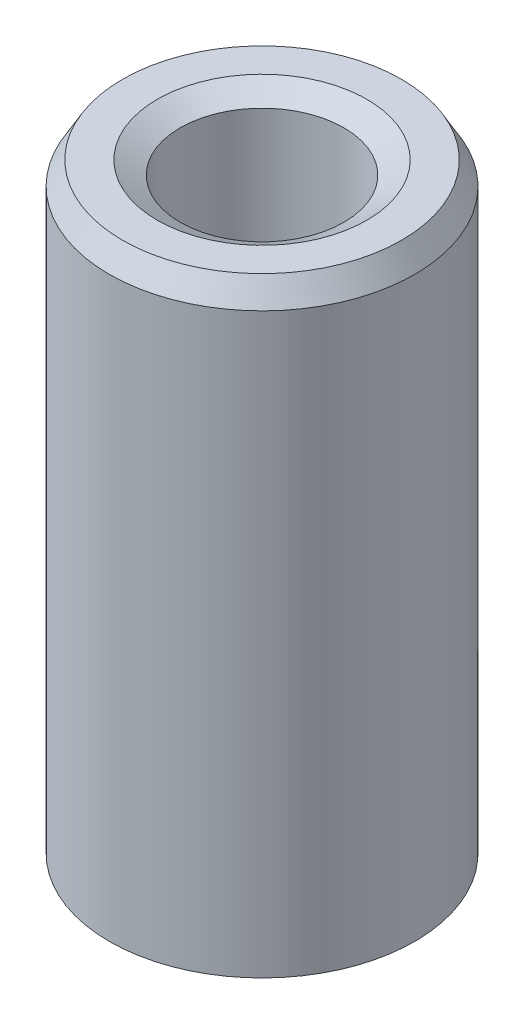
ISO-10303-21;
HEADER;
FILE_DESCRIPTION(('STEP AP214'),'2;1');
FILE_NAME('part.step','',(''),(''),'','','');
FILE_SCHEMA(('AUTOMOTIVE_DESIGN { 1 0 10303 214 1 1 1 1 }'));
ENDSEC;
DATA;
#1=APPLICATION_CONTEXT('core data for automotive mechanical design processes');
#2=APPLICATION_PROTOCOL_DEFINITION('international standard','automotive_design',2000,#1);
#3=PRODUCT_CONTEXT('',#1,'mechanical');
#4=PRODUCT('Part','Part','',(#3));
#5=PRODUCT_RELATED_PRODUCT_CATEGORY('part','',(#4));
#6=PRODUCT_DEFINITION_FORMATION('','',#4);
#7=PRODUCT_DEFINITION_CONTEXT('part definition',#1,'design');
#8=PRODUCT_DEFINITION('design','',#6,#7);
#9=PRODUCT_DEFINITION_SHAPE('','',#8);
#10=(LENGTH_UNIT() NAMED_UNIT(*) SI_UNIT(.MILLI.,.METRE.));
#11=(NAMED_UNIT(*) PLANE_ANGLE_UNIT() SI_UNIT($,.RADIAN.));
#12=(NAMED_UNIT(*) SI_UNIT($,.STERADIAN.) SOLID_ANGLE_UNIT());
#13=UNCERTAINTY_MEASURE_WITH_UNIT(LENGTH_MEASURE(1.E-05),#10,'distance_accuracy_value','');
#14=(GEOMETRIC_REPRESENTATION_CONTEXT(3) GLOBAL_UNCERTAINTY_ASSIGNED_CONTEXT((#13)) GLOBAL_UNIT_ASSIGNED_CONTEXT((#10,
#11,#12)) REPRESENTATION_CONTEXT('',''));
#15=CARTESIAN_POINT('',(0.,0.,0.));
#16=DIRECTION('',(0.,0.,1.));
#17=DIRECTION('',(1.,0.,0.));
#18=AXIS2_PLACEMENT_3D('',#15,#16,#17);
#19=CARTESIAN_POINT('',(0.,60.2965456338634,0.));
#20=DIRECTION('',(0.,-1.,0.));
#21=DIRECTION('',(0.,0.,-1.));
#22=AXIS2_PLACEMENT_3D('',#19,#20,#21);
#23=CYLINDRICAL_SURFACE('',#22,15.);
#24=CARTESIAN_POINT('',(0.,1.29841179703524,0.));
#25=DIRECTION('',(0.,1.,0.));
#26=DIRECTION('',(0.,0.,1.));
#27=AXIS2_PLACEMENT_3D('',#24,#25,#26);
#28=CIRCLE('',#27,15.);
#29=CARTESIAN_POINT('',(0.,1.29841179703524,15.));
#30=VERTEX_POINT('',#29);
#31=EDGE_CURVE('E10',#30,#30,#28,.T.);
#32=ORIENTED_EDGE('',*,*,#31,.T.);
#33=EDGE_LOOP('',(#32));
#34=FACE_BOUND('',#33,.T.);
#35=CARTESIAN_POINT('',(0.,58.0476304322516,0.));
#36=DIRECTION('',(0.,1.,0.));
#37=DIRECTION('',(0.,0.,1.));
#38=AXIS2_PLACEMENT_3D('',#35,#36,#37);
#39=CIRCLE('',#38,15.);
#40=CARTESIAN_POINT('',(0.,58.0476304322516,15.));
#41=VERTEX_POINT('',#40);
#42=EDGE_CURVE('E50',#41,#41,#39,.F.);
#43=ORIENTED_EDGE('',*,*,#42,.T.);
#44=EDGE_LOOP('',(#43));
#45=FACE_BOUND('',#44,.T.);
#46=ADVANCED_FACE('F39',(#34,#45),#23,.T.);
#47=CARTESIAN_POINT('',(0.,60.2965456338634,0.));
#48=DIRECTION('',(0.,1.,0.));
#49=DIRECTION('',(0.,0.,1.));
#50=AXIS2_PLACEMENT_3D('',#47,#48,#49);
#51=PLANE('',#50);
#52=CARTESIAN_POINT('',(0.,60.2965456338634,0.));
#53=DIRECTION('',(0.,1.,0.));
#54=DIRECTION('',(0.,0.,1.));
#55=AXIS2_PLACEMENT_3D('',#52,#53,#54);
#56=CIRCLE('',#55,10.293324658805);
#57=CARTESIAN_POINT('',(0.,60.2965456338634,10.293324658805));
#58=VERTEX_POINT('',#57);
#59=EDGE_CURVE('E58',#58,#58,#56,.F.);
#60=ORIENTED_EDGE('',*,*,#59,.T.);
#61=EDGE_LOOP('',(#60));
#62=FACE_BOUND('',#61,.T.);
#63=CARTESIAN_POINT('',(0.,60.2965456338634,0.));
#64=DIRECTION('',(0.,1.,0.));
#65=DIRECTION('',(0.,0.,1.));
#66=AXIS2_PLACEMENT_3D('',#63,#64,#65);
#67=CIRCLE('',#66,13.7015882029648);
#68=CARTESIAN_POINT('',(0.,60.2965456338634,13.7015882029648));
#69=VERTEX_POINT('',#68);
#70=EDGE_CURVE('E61',#69,#69,#67,.T.);
#71=ORIENTED_EDGE('',*,*,#70,.T.);
#72=EDGE_LOOP('',(#71));
#73=FACE_BOUND('',#72,.T.);
#74=ADVANCED_FACE('F88',(#62,#73),#51,.T.);
#75=CARTESIAN_POINT('',(0.,0.,0.));
#76=DIRECTION('',(0.,1.,0.));
#77=DIRECTION('',(0.,0.,1.));
#78=AXIS2_PLACEMENT_3D('',#75,#76,#77);
#79=PLANE('',#78);
#80=CARTESIAN_POINT('',(0.,0.,0.));
#81=DIRECTION('',(0.,1.,0.));
#82=DIRECTION('',(0.,0.,1.));
#83=AXIS2_PLACEMENT_3D('',#80,#81,#82);
#84=CIRCLE('',#83,9.34282125422839);
#85=CARTESIAN_POINT('',(0.,0.,9.34282125422839));
#86=VERTEX_POINT('',#85);
#87=EDGE_CURVE('E51',#86,#86,#84,.T.);
#88=ORIENTED_EDGE('',*,*,#87,.T.);
#89=EDGE_LOOP('',(#88));
#90=FACE_BOUND('',#89,.T.);
#91=CARTESIAN_POINT('',(0.,0.,0.));
#92=DIRECTION('',(0.,1.,0.));
#93=DIRECTION('',(0.,0.,1.));
#94=AXIS2_PLACEMENT_3D('',#91,#92,#93);
#95=CIRCLE('',#94,12.7510847983881);
#96=CARTESIAN_POINT('',(0.,0.,12.7510847983881));
#97=VERTEX_POINT('',#96);
#98=EDGE_CURVE('E54',#97,#97,#95,.F.);
#99=ORIENTED_EDGE('',*,*,#98,.T.);
#100=EDGE_LOOP('',(#99));
#101=FACE_BOUND('',#100,.T.);
#102=ADVANCED_FACE('F83',(#90,#101),#79,.F.);
#103=CARTESIAN_POINT('',(0.,60.2965456338634,0.));
#104=DIRECTION('',(0.,-1.,0.));
#105=DIRECTION('',(0.,0.,-1.));
#106=AXIS2_PLACEMENT_3D('',#103,#104,#105);
#107=CYLINDRICAL_SURFACE('',#106,8.04440945719315);
#108=CARTESIAN_POINT('',(0.,58.9981338368282,0.));
#109=DIRECTION('',(0.,1.,0.));
#110=DIRECTION('',(0.,0.,1.));
#111=AXIS2_PLACEMENT_3D('',#108,#109,#110);
#112=CIRCLE('',#111,8.04440945719315);
#113=CARTESIAN_POINT('',(0.,58.9981338368282,8.04440945719315));
#114=VERTEX_POINT('',#113);
#115=EDGE_CURVE('E67',#114,#114,#112,.T.);
#116=ORIENTED_EDGE('',*,*,#115,.T.);
#117=EDGE_LOOP('',(#116));
#118=FACE_BOUND('',#117,.T.);
#119=CARTESIAN_POINT('',(0.,2.24891520161187,0.));
#120=DIRECTION('',(0.,1.,0.));
#121=DIRECTION('',(0.,0.,1.));
#122=AXIS2_PLACEMENT_3D('',#119,#120,#121);
#123=CIRCLE('',#122,8.04440945719315);
#124=CARTESIAN_POINT('',(0.,2.24891520161187,8.04440945719315));
#125=VERTEX_POINT('',#124);
#126=EDGE_CURVE('E69',#125,#125,#123,.F.);
#127=ORIENTED_EDGE('',*,*,#126,.T.);
#128=EDGE_LOOP('',(#127));
#129=FACE_BOUND('',#128,.T.);
#130=ADVANCED_FACE('F71',(#118,#129),#107,.F.);
#131=CARTESIAN_POINT('',(0.,58.9981338368282,0.));
#132=DIRECTION('',(0.,1.,0.));
#133=DIRECTION('',(0.,0.,1.));
#134=AXIS2_PLACEMENT_3D('',#131,#132,#133);
#135=CONICAL_SURFACE('',#134,8.04440945719315,1.0471975511966);
#136=ORIENTED_EDGE('',*,*,#59,.F.);
#137=EDGE_LOOP('',(#136));
#138=FACE_BOUND('',#137,.T.);
#139=ORIENTED_EDGE('',*,*,#115,.F.);
#140=EDGE_LOOP('',(#139));
#141=FACE_BOUND('',#140,.T.);
#142=ADVANCED_FACE('F77',(#138,#141),#135,.F.);
#143=CARTESIAN_POINT('',(0.,0.,0.));
#144=DIRECTION('',(0.,-1.,0.));
#145=DIRECTION('',(0.,0.,-1.));
#146=AXIS2_PLACEMENT_3D('',#143,#144,#145);
#147=CONICAL_SURFACE('',#146,9.34282125422839,0.523598775598296);
#148=ORIENTED_EDGE('',*,*,#126,.F.);
#149=EDGE_LOOP('',(#148));
#150=FACE_BOUND('',#149,.T.);
#151=ORIENTED_EDGE('',*,*,#87,.F.);
#152=EDGE_LOOP('',(#151));
#153=FACE_BOUND('',#152,.T.);
#154=ADVANCED_FACE('F73',(#150,#153),#147,.F.);
#155=CARTESIAN_POINT('',(0.,1.29841179703524,0.));
#156=DIRECTION('',(0.,1.,0.));
#157=DIRECTION('',(0.,0.,1.));
#158=AXIS2_PLACEMENT_3D('',#155,#156,#157);
#159=CONICAL_SURFACE('',#158,15.,1.0471975511966);
#160=CARTESIAN_POINT('',(0.,0.,12.7510847983881));
#161=CARTESIAN_POINT('',(0.,0.0135251228857835,12.7745109984049));
#162=CARTESIAN_POINT('',(0.,0.0270502457715672,12.7979371984217));
#163=CARTESIAN_POINT('',(0.,0.0541004915431346,12.8447895984553));
#164=CARTESIAN_POINT('',(0.,0.0676256144289183,12.8682157984721));
#165=CARTESIAN_POINT('',(0.,0.0946758602004857,12.9150681985057));
#166=CARTESIAN_POINT('',(0.,0.108200983086269,12.9384943985225));
#167=CARTESIAN_POINT('',(0.,0.135251228857837,12.985346798556));
#168=CARTESIAN_POINT('',(0.,0.148776351743621,13.0087729985728));
#169=CARTESIAN_POINT('',(0.,0.175826597515188,13.0556253986064));
#170=CARTESIAN_POINT('',(0.,0.189351720400972,13.0790515986232));
#171=CARTESIAN_POINT('',(0.,0.216401966172539,13.1259039986568));
#172=CARTESIAN_POINT('',(0.,0.229927089058323,13.1493301986736));
#173=CARTESIAN_POINT('',(0.,0.25697733482989,13.1961825987071));
#174=CARTESIAN_POINT('',(0.,0.270502457715674,13.2196087987239));
#175=CARTESIAN_POINT('',(0.,0.297552703487241,13.2664611987575));
#176=CARTESIAN_POINT('',(0.,0.311077826373025,13.2898873987743));
#177=CARTESIAN_POINT('',(0.,0.338128072144592,13.3367397988079));
#178=CARTESIAN_POINT('',(0.,0.351653195030376,13.3601659988247));
#179=CARTESIAN_POINT('',(0.,0.378703440801944,13.4070183988583));
#180=CARTESIAN_POINT('',(0.,0.392228563687727,13.430444598875));
#181=CARTESIAN_POINT('',(0.,0.419278809459295,13.4772969989086));
#182=CARTESIAN_POINT('',(0.,0.432803932345079,13.5007231989254));
#183=CARTESIAN_POINT('',(0.,0.459854178116646,13.547575598959));
#184=CARTESIAN_POINT('',(0.,0.47337930100243,13.5710017989758));
#185=CARTESIAN_POINT('',(0.,0.500429546773997,13.6178541990094));
#186=CARTESIAN_POINT('',(0.,0.513954669659781,13.6412803990262));
#187=CARTESIAN_POINT('',(0.,0.541004915431348,13.6881327990597));
#188=CARTESIAN_POINT('',(0.,0.554530038317132,13.7115589990765));
#189=CARTESIAN_POINT('',(0.,0.581580284088699,13.7584113991101));
#190=CARTESIAN_POINT('',(0.,0.595105406974483,13.7818375991269));
#191=CARTESIAN_POINT('',(0.,0.62215565274605,13.8286899991605));
#192=CARTESIAN_POINT('',(0.,0.635680775631834,13.8521161991773));
#193=CARTESIAN_POINT('',(0.,0.662731021403401,13.8989685992109));
#194=CARTESIAN_POINT('',(0.,0.676256144289185,13.9223947992276));
#195=CARTESIAN_POINT('',(0.,0.703306390060753,13.9692471992612));
#196=CARTESIAN_POINT('',(0.,0.716831512946536,13.992673399278));
#197=CARTESIAN_POINT('',(0.,0.743881758718104,14.0395257993116));
#198=CARTESIAN_POINT('',(0.,0.757406881603888,14.0629519993284));
#199=CARTESIAN_POINT('',(0.,0.784457127375455,14.109804399362));
#200=CARTESIAN_POINT('',(0.,0.797982250261238,14.1332305993788));
#201=CARTESIAN_POINT('',(0.,0.825032496032806,14.1800829994123));
#202=CARTESIAN_POINT('',(0.,0.83855761891859,14.2035091994291));
#203=CARTESIAN_POINT('',(0.,0.865607864690157,14.2503615994627));
#204=CARTESIAN_POINT('',(0.,0.879132987575941,14.2737877994795));
#205=CARTESIAN_POINT('',(0.,0.906183233347508,14.3206401995131));
#206=CARTESIAN_POINT('',(0.,0.919708356233292,14.3440663995299));
#207=CARTESIAN_POINT('',(0.,0.946758602004859,14.3909187995635));
#208=CARTESIAN_POINT('',(0.,0.960283724890643,14.4143449995802));
#209=CARTESIAN_POINT('',(0.,0.987333970662211,14.4611973996138));
#210=CARTESIAN_POINT('',(0.,1.00085909354799,14.4846235996306));
#211=CARTESIAN_POINT('',(0.,1.02790933931956,14.5314759996642));
#212=CARTESIAN_POINT('',(0.,1.04143446220535,14.554902199681));
#213=CARTESIAN_POINT('',(0.,1.06848470797691,14.6017545997146));
#214=CARTESIAN_POINT('',(0.,1.0820098308627,14.6251807997314));
#215=CARTESIAN_POINT('',(0.,1.10906007663426,14.6720331997649));
#216=CARTESIAN_POINT('',(0.,1.12258519952005,14.6954593997817));
#217=CARTESIAN_POINT('',(0.,1.14963544529161,14.7423117998153));
#218=CARTESIAN_POINT('',(0.,1.1631605681774,14.7657379998321));
#219=CARTESIAN_POINT('',(0.,1.19021081394897,14.8125903998657));
#220=CARTESIAN_POINT('',(0.,1.20373593683475,14.8360165998825));
#221=CARTESIAN_POINT('',(0.,1.23078618260632,14.882868999916));
#222=CARTESIAN_POINT('',(0.,1.2443113054921,14.9062951999328));
#223=CARTESIAN_POINT('',(0.,1.27136155126367,14.9531475999664));
#224=CARTESIAN_POINT('',(0.,1.28488667414945,14.9765737999832));
#225=CARTESIAN_POINT('',(0.,1.29841179703524,15.));
#226=B_SPLINE_CURVE_WITH_KNOTS('',3,(#160,#161,#162,#163,#164,#165,#166,#167,#168,#169,#170,
#171,#172,#173,#174,#175,#176,#177,#178,#179,#180,#181,#182,#183,#184,#185,#186,#187,#188,#189,
#190,#191,#192,#193,#194,#195,#196,#197,#198,#199,#200,#201,#202,#203,#204,#205,#206,#207,#208,
#209,#210,#211,#212,#213,#214,#215,#216,#217,#218,#219,#220,#221,#222,#223,#224,#225),
.UNSPECIFIED.,.F.,.F.,(4,2,2,2,2,2,2,2,2,2,2,2,2,2,2,2,2,2,2,2,2,2,2,2,2,2,2,2,2,2,2,2,4),(0.,
0.0811507373147028,0.162301474629406,0.243452211944108,0.324602949258811,0.405753686573515,
0.486904423888218,0.568055161202922,0.649205898517625,0.730356635832328,0.811507373147031,
0.892658110461733,0.973808847776438,1.05495958509114,1.13611032240584,1.21726105972055,
1.29841179703525,1.37956253434995,1.46071327166466,1.54186400897936,1.62301474629406,
1.70416548360876,1.78531622092347,1.86646695823817,1.94761769555287,2.02876843286758,
2.10991917018228,2.19106990749698,2.27222064481169,2.35337138212639,2.43452211944109,
2.5156728567558,2.5968235940705),.UNSPECIFIED.);
#227=EDGE_CURVE('BSEAM76',#97,#30,#226,.T.);
#228=ORIENTED_EDGE('',*,*,#98,.F.);
#229=ORIENTED_EDGE('',*,*,#31,.F.);
#230=ORIENTED_EDGE('',*,*,#227,.T.);
#231=ORIENTED_EDGE('',*,*,#227,.F.);
#232=EDGE_LOOP('',(#228,#230,#229,#231));
#233=FACE_BOUND('',#232,.T.);
#234=ADVANCED_FACE('F76',(#233),#159,.T.);
#235=CARTESIAN_POINT('',(0.,60.2965456338634,0.));
#236=DIRECTION('',(0.,-1.,0.));
#237=DIRECTION('',(0.,0.,-1.));
#238=AXIS2_PLACEMENT_3D('',#235,#236,#237);
#239=CONICAL_SURFACE('',#238,13.7015882029648,0.523598775598294);
#240=ORIENTED_EDGE('',*,*,#42,.F.);
#241=EDGE_LOOP('',(#240));
#242=FACE_BOUND('',#241,.T.);
#243=ORIENTED_EDGE('',*,*,#70,.F.);
#244=EDGE_LOOP('',(#243));
#245=FACE_BOUND('',#244,.T.);
#246=ADVANCED_FACE('F45',(#242,#245),#239,.T.);
#247=CLOSED_SHELL('',(#46,#74,#102,#130,#142,#154,#234,#246));
#248=MANIFOLD_SOLID_BREP('B2',#247);
#249=ADVANCED_BREP_SHAPE_REPRESENTATION('',(#18,#248),#14);
#250=SHAPE_DEFINITION_REPRESENTATION(#9,#249);
ENDSEC;
END-ISO-10303-21;
